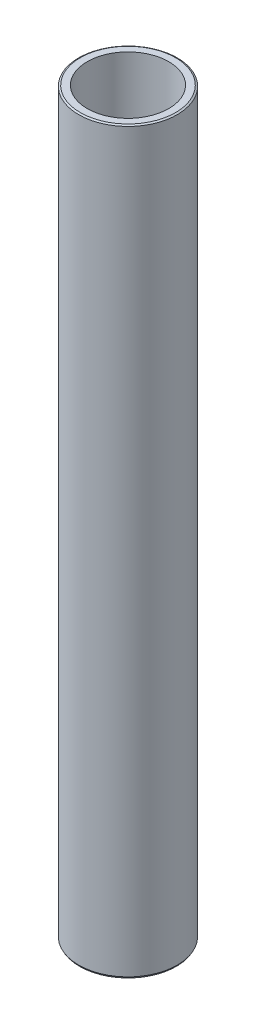
ISO-10303-21;
HEADER;
FILE_DESCRIPTION(('STEP AP214'),'2;1');
FILE_NAME('part.step','',(''),(''),'','','');
FILE_SCHEMA(('AUTOMOTIVE_DESIGN { 1 0 10303 214 1 1 1 1 }'));
ENDSEC;
DATA;
#1=APPLICATION_CONTEXT('core data for automotive mechanical design processes');
#2=APPLICATION_PROTOCOL_DEFINITION('international standard','automotive_design',2000,#1);
#3=PRODUCT_CONTEXT('',#1,'mechanical');
#4=PRODUCT('Part','Part','',(#3));
#5=PRODUCT_RELATED_PRODUCT_CATEGORY('part','',(#4));
#6=PRODUCT_DEFINITION_FORMATION('','',#4);
#7=PRODUCT_DEFINITION_CONTEXT('part definition',#1,'design');
#8=PRODUCT_DEFINITION('design','',#6,#7);
#9=PRODUCT_DEFINITION_SHAPE('','',#8);
#10=(LENGTH_UNIT() NAMED_UNIT(*) SI_UNIT(.MILLI.,.METRE.));
#11=(NAMED_UNIT(*) PLANE_ANGLE_UNIT() SI_UNIT($,.RADIAN.));
#12=(NAMED_UNIT(*) SI_UNIT($,.STERADIAN.) SOLID_ANGLE_UNIT());
#13=UNCERTAINTY_MEASURE_WITH_UNIT(LENGTH_MEASURE(1.E-05),#10,'distance_accuracy_value','');
#14=(GEOMETRIC_REPRESENTATION_CONTEXT(3) GLOBAL_UNCERTAINTY_ASSIGNED_CONTEXT((#13)) GLOBAL_UNIT_ASSIGNED_CONTEXT((#10,
#11,#12)) REPRESENTATION_CONTEXT('',''));
#15=CARTESIAN_POINT('',(0.,0.,0.));
#16=DIRECTION('',(0.,0.,1.));
#17=DIRECTION('',(1.,0.,0.));
#18=AXIS2_PLACEMENT_3D('',#15,#16,#17);
#19=CARTESIAN_POINT('',(0.,600.,0.));
#20=DIRECTION('',(0.,-1.,0.));
#21=DIRECTION('',(0.,0.,-1.));
#22=AXIS2_PLACEMENT_3D('',#19,#20,#21);
#23=CYLINDRICAL_SURFACE('',#22,40.);
#24=CARTESIAN_POINT('',(0.,599.223743177284,0.));
#25=DIRECTION('',(0.,1.,0.));
#26=DIRECTION('',(0.,0.,1.));
#27=AXIS2_PLACEMENT_3D('',#24,#25,#26);
#28=CIRCLE('',#27,40.);
#29=CARTESIAN_POINT('',(0.,599.223743177284,40.));
#30=VERTEX_POINT('',#29);
#31=EDGE_CURVE('E50',#30,#30,#28,.F.);
#32=ORIENTED_EDGE('',*,*,#31,.T.);
#33=EDGE_LOOP('',(#32));
#34=FACE_BOUND('',#33,.T.);
#35=CARTESIAN_POINT('',(0.,1.34451625666543,0.));
#36=DIRECTION('',(0.,1.,0.));
#37=DIRECTION('',(0.,0.,1.));
#38=AXIS2_PLACEMENT_3D('',#35,#36,#37);
#39=CIRCLE('',#38,40.);
#40=CARTESIAN_POINT('',(0.,1.34451625666543,40.));
#41=VERTEX_POINT('',#40);
#42=EDGE_CURVE('E51',#41,#41,#39,.T.);
#43=ORIENTED_EDGE('',*,*,#42,.T.);
#44=EDGE_LOOP('',(#43));
#45=FACE_BOUND('',#44,.T.);
#46=ADVANCED_FACE('F39',(#34,#45),#23,.T.);
#47=CARTESIAN_POINT('',(0.,600.,0.));
#48=DIRECTION('',(0.,1.,0.));
#49=DIRECTION('',(0.,0.,1.));
#50=AXIS2_PLACEMENT_3D('',#47,#48,#49);
#51=PLANE('',#50);
#52=CARTESIAN_POINT('',(0.,600.,0.));
#53=DIRECTION('',(0.,1.,0.));
#54=DIRECTION('',(0.,0.,1.));
#55=AXIS2_PLACEMENT_3D('',#52,#53,#54);
#56=CIRCLE('',#55,38.6554837433347);
#57=CARTESIAN_POINT('',(0.,600.,38.6554837433347));
#58=VERTEX_POINT('',#57);
#59=EDGE_CURVE('E54',#58,#58,#56,.T.);
#60=ORIENTED_EDGE('',*,*,#59,.T.);
#61=EDGE_LOOP('',(#60));
#62=FACE_BOUND('',#61,.T.);
#63=CARTESIAN_POINT('',(0.,600.,0.));
#64=DIRECTION('',(0.,1.,0.));
#65=DIRECTION('',(0.,0.,1.));
#66=AXIS2_PLACEMENT_3D('',#63,#64,#65);
#67=CIRCLE('',#66,33.0726578726125);
#68=CARTESIAN_POINT('',(0.,600.,33.0726578726125));
#69=VERTEX_POINT('',#68);
#70=EDGE_CURVE('E58',#69,#69,#67,.T.);
#71=ORIENTED_EDGE('',*,*,#70,.F.);
#72=EDGE_LOOP('',(#71));
#73=FACE_BOUND('',#72,.T.);
#74=ADVANCED_FACE('F69',(#62,#73),#51,.T.);
#75=CARTESIAN_POINT('',(0.,0.,0.));
#76=DIRECTION('',(0.,1.,0.));
#77=DIRECTION('',(0.,0.,1.));
#78=AXIS2_PLACEMENT_3D('',#75,#76,#77);
#79=PLANE('',#78);
#80=CARTESIAN_POINT('',(0.,0.,0.));
#81=DIRECTION('',(0.,1.,0.));
#82=DIRECTION('',(0.,0.,1.));
#83=AXIS2_PLACEMENT_3D('',#80,#81,#82);
#84=CIRCLE('',#83,39.2237431772844);
#85=CARTESIAN_POINT('',(0.,0.,39.2237431772844));
#86=VERTEX_POINT('',#85);
#87=EDGE_CURVE('E10',#86,#86,#84,.F.);
#88=ORIENTED_EDGE('',*,*,#87,.T.);
#89=EDGE_LOOP('',(#88));
#90=FACE_BOUND('',#89,.T.);
#91=CARTESIAN_POINT('',(0.,0.,0.));
#92=DIRECTION('',(0.,1.,0.));
#93=DIRECTION('',(0.,0.,1.));
#94=AXIS2_PLACEMENT_3D('',#91,#92,#93);
#95=CIRCLE('',#94,33.0726578726125);
#96=CARTESIAN_POINT('',(0.,0.,33.0726578726125));
#97=VERTEX_POINT('',#96);
#98=EDGE_CURVE('E63',#97,#97,#95,.T.);
#99=ORIENTED_EDGE('',*,*,#98,.T.);
#100=EDGE_LOOP('',(#99));
#101=FACE_BOUND('',#100,.T.);
#102=ADVANCED_FACE('F75',(#90,#101),#79,.F.);
#103=CARTESIAN_POINT('',(0.,600.,0.));
#104=DIRECTION('',(0.,-1.,0.));
#105=DIRECTION('',(0.,0.,-1.));
#106=AXIS2_PLACEMENT_3D('',#103,#104,#105);
#107=CYLINDRICAL_SURFACE('',#106,33.0726578726125);
#108=ORIENTED_EDGE('',*,*,#70,.T.);
#109=EDGE_LOOP('',(#108));
#110=FACE_BOUND('',#109,.T.);
#111=ORIENTED_EDGE('',*,*,#98,.F.);
#112=EDGE_LOOP('',(#111));
#113=FACE_BOUND('',#112,.T.);
#114=ADVANCED_FACE('F70',(#110,#113),#107,.F.);
#115=CARTESIAN_POINT('',(0.,600.,0.));
#116=DIRECTION('',(0.,-1.,0.));
#117=DIRECTION('',(0.,0.,-1.));
#118=AXIS2_PLACEMENT_3D('',#115,#116,#117);
#119=CONICAL_SURFACE('',#118,38.6554837433347,1.04719755119659);
#120=ORIENTED_EDGE('',*,*,#31,.F.);
#121=EDGE_LOOP('',(#120));
#122=FACE_BOUND('',#121,.T.);
#123=ORIENTED_EDGE('',*,*,#59,.F.);
#124=EDGE_LOOP('',(#123));
#125=FACE_BOUND('',#124,.T.);
#126=ADVANCED_FACE('F81',(#122,#125),#119,.T.);
#127=CARTESIAN_POINT('',(0.,1.34451625666543,0.));
#128=DIRECTION('',(0.,1.,0.));
#129=DIRECTION('',(0.,0.,1.));
#130=AXIS2_PLACEMENT_3D('',#127,#128,#129);
#131=CONICAL_SURFACE('',#130,40.,0.523598775598299);
#132=ORIENTED_EDGE('',*,*,#87,.F.);
#133=EDGE_LOOP('',(#132));
#134=FACE_BOUND('',#133,.T.);
#135=ORIENTED_EDGE('',*,*,#42,.F.);
#136=EDGE_LOOP('',(#135));
#137=FACE_BOUND('',#136,.T.);
#138=ADVANCED_FACE('F45',(#134,#137),#131,.T.);
#139=CLOSED_SHELL('',(#46,#74,#102,#114,#126,#138));
#140=MANIFOLD_SOLID_BREP('B2',#139);
#141=ADVANCED_BREP_SHAPE_REPRESENTATION('',(#18,#140),#14);
#142=SHAPE_DEFINITION_REPRESENTATION(#9,#141);
ENDSEC;
END-ISO-10303-21;
